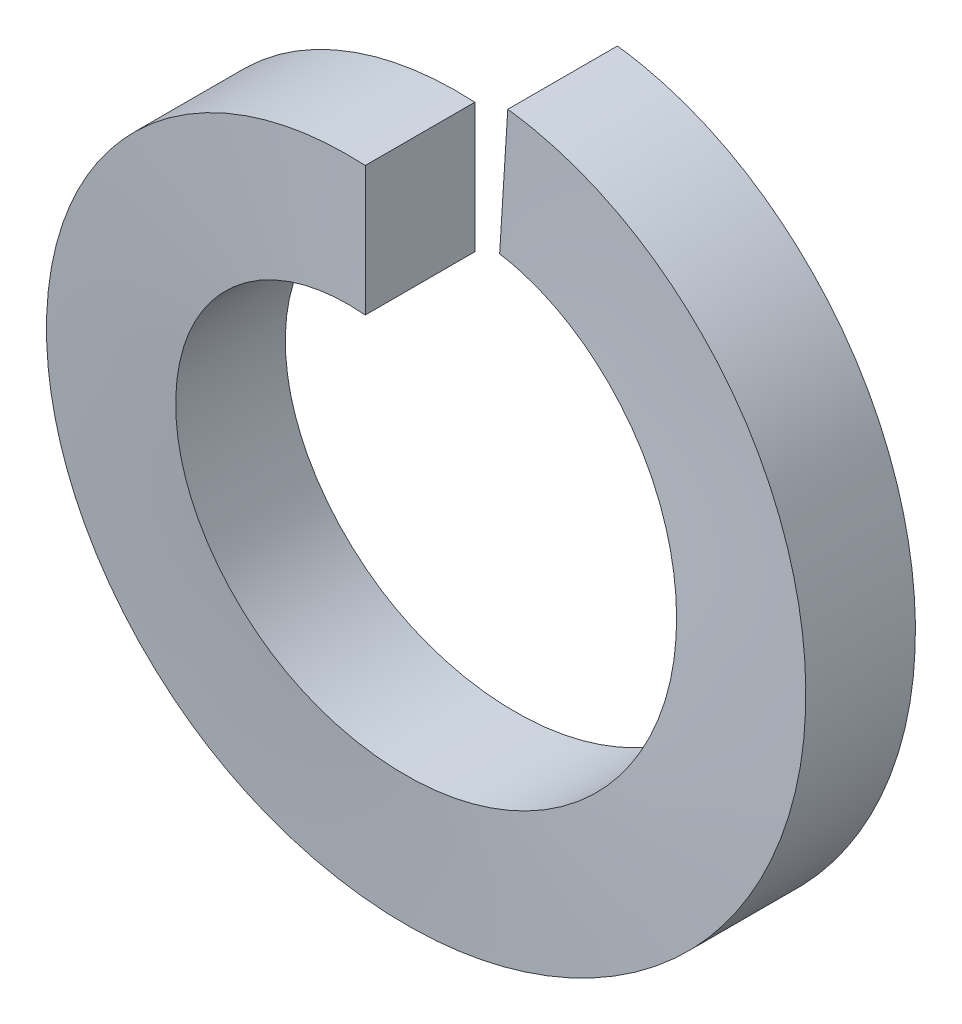
ISO-10303-21;
HEADER;
FILE_DESCRIPTION(('STEP AP214'),'2;1');
FILE_NAME('part.step','',(''),(''),'','','');
FILE_SCHEMA(('AUTOMOTIVE_DESIGN { 1 0 10303 214 1 1 1 1 }'));
ENDSEC;
DATA;
#1=APPLICATION_CONTEXT('core data for automotive mechanical design processes');
#2=APPLICATION_PROTOCOL_DEFINITION('international standard','automotive_design',2000,#1);
#3=PRODUCT_CONTEXT('',#1,'mechanical');
#4=PRODUCT('Part','Part','',(#3));
#5=PRODUCT_RELATED_PRODUCT_CATEGORY('part','',(#4));
#6=PRODUCT_DEFINITION_FORMATION('','',#4);
#7=PRODUCT_DEFINITION_CONTEXT('part definition',#1,'design');
#8=PRODUCT_DEFINITION('design','',#6,#7);
#9=PRODUCT_DEFINITION_SHAPE('','',#8);
#10=(LENGTH_UNIT() NAMED_UNIT(*) SI_UNIT(.MILLI.,.METRE.));
#11=(NAMED_UNIT(*) PLANE_ANGLE_UNIT() SI_UNIT($,.RADIAN.));
#12=(NAMED_UNIT(*) SI_UNIT($,.STERADIAN.) SOLID_ANGLE_UNIT());
#13=UNCERTAINTY_MEASURE_WITH_UNIT(LENGTH_MEASURE(1.E-05),#10,'distance_accuracy_value','');
#14=(GEOMETRIC_REPRESENTATION_CONTEXT(3) GLOBAL_UNCERTAINTY_ASSIGNED_CONTEXT((#13)) GLOBAL_UNIT_ASSIGNED_CONTEXT((#10,
#11,#12)) REPRESENTATION_CONTEXT('',''));
#15=CARTESIAN_POINT('',(0.,0.,0.));
#16=DIRECTION('',(0.,0.,1.));
#17=DIRECTION('',(1.,0.,0.));
#18=AXIS2_PLACEMENT_3D('',#15,#16,#17);
#19=CARTESIAN_POINT('',(0.,2.85,1.1));
#20=DIRECTION('',(1.,0.,0.));
#21=DIRECTION('',(0.,1.,0.));
#22=AXIS2_PLACEMENT_3D('',#19,#20,#21);
#23=PLANE('',#22);
#24=CARTESIAN_POINT('',(0.,3.5,1.1));
#25=CARTESIAN_POINT('',(0.,2.2,1.1));
#26=(BOUNDED_CURVE() B_SPLINE_CURVE(1,(#24,#25),.UNSPECIFIED.,.F.,
.F.) B_SPLINE_CURVE_WITH_KNOTS((2,2),(0.,1.),
.UNSPECIFIED.) CURVE() GEOMETRIC_REPRESENTATION_ITEM() RATIONAL_B_SPLINE_CURVE((1.,1.)) REPRESENTATION_ITEM(''));
#27=CARTESIAN_POINT('',(0.,3.5,1.1));
#28=VERTEX_POINT('',#27);
#29=CARTESIAN_POINT('',(0.,2.2,1.1));
#30=VERTEX_POINT('',#29);
#31=EDGE_CURVE('E32',#28,#30,#26,.T.);
#32=ORIENTED_EDGE('',*,*,#31,.T.);
#33=CARTESIAN_POINT('',(0.,2.2,1.1));
#34=CARTESIAN_POINT('',(0.,2.2,0.));
#35=(BOUNDED_CURVE() B_SPLINE_CURVE(1,(#33,#34),.UNSPECIFIED.,.F.,
.F.) B_SPLINE_CURVE_WITH_KNOTS((2,2),(0.,1.),
.UNSPECIFIED.) CURVE() GEOMETRIC_REPRESENTATION_ITEM() RATIONAL_B_SPLINE_CURVE((1.,1.)) REPRESENTATION_ITEM(''));
#36=CARTESIAN_POINT('',(0.,2.2,0.));
#37=VERTEX_POINT('',#36);
#38=EDGE_CURVE('E91',#30,#37,#35,.T.);
#39=ORIENTED_EDGE('',*,*,#38,.T.);
#40=CARTESIAN_POINT('',(0.,2.2,0.));
#41=CARTESIAN_POINT('',(0.,3.5,0.));
#42=(BOUNDED_CURVE() B_SPLINE_CURVE(1,(#40,#41),.UNSPECIFIED.,.F.,
.F.) B_SPLINE_CURVE_WITH_KNOTS((2,2),(0.,1.),
.UNSPECIFIED.) CURVE() GEOMETRIC_REPRESENTATION_ITEM() RATIONAL_B_SPLINE_CURVE((1.,1.)) REPRESENTATION_ITEM(''));
#43=CARTESIAN_POINT('',(0.,3.5,0.));
#44=VERTEX_POINT('',#43);
#45=EDGE_CURVE('E73',#37,#44,#42,.T.);
#46=ORIENTED_EDGE('',*,*,#45,.T.);
#47=CARTESIAN_POINT('',(0.,3.5,0.));
#48=CARTESIAN_POINT('',(0.,3.5,1.1));
#49=(BOUNDED_CURVE() B_SPLINE_CURVE(1,(#47,#48),.UNSPECIFIED.,.F.,
.F.) B_SPLINE_CURVE_WITH_KNOTS((2,2),(0.,1.),
.UNSPECIFIED.) CURVE() GEOMETRIC_REPRESENTATION_ITEM() RATIONAL_B_SPLINE_CURVE((1.,1.)) REPRESENTATION_ITEM(''));
#50=EDGE_CURVE('E117',#44,#28,#49,.T.);
#51=ORIENTED_EDGE('',*,*,#50,.T.);
#52=EDGE_LOOP('',(#32,#39,#46,#51));
#53=FACE_BOUND('',#52,.T.);
#54=ADVANCED_FACE('F16',(#53),#23,.T.);
#55=CARTESIAN_POINT('',(0.158565109434232,2.52001629083427,-0.110490288185668));
#56=DIRECTION('',(0.998026253327476,-0.0627980631128052,3.06333390339743E-05));
#57=DIRECTION('',(0.,-0.000487807009815868,-0.999999881022154));
#58=AXIS2_PLACEMENT_3D('',#55,#56,#57);
#59=PLANE('',#58);
#60=CARTESIAN_POINT('',(0.219793220997946,3.49309188828513,-0.110490288185668));
#61=CARTESIAN_POINT('',(0.216392495218927,3.43903208027009,-0.110490242989147));
#62=CARTESIAN_POINT('',(0.21299173062682,3.38497227469665,-0.110490197792619));
#63=CARTESIAN_POINT('',(0.206190123816456,3.27685266843367,-0.110490107399545));
#64=CARTESIAN_POINT('',(0.202789281598198,3.22279286774412,-0.110490062203));
#65=CARTESIAN_POINT('',(0.195987519535522,3.11467327124901,-0.110489971809893));
#66=CARTESIAN_POINT('',(0.192586599691102,3.06061347544345,-0.110489926613332));
#67=CARTESIAN_POINT('',(0.185784682376099,2.95249388871638,-0.110489836220192));
#68=CARTESIAN_POINT('',(0.182383684905515,2.89843409779487,-0.110489791023614));
#69=CARTESIAN_POINT('',(0.17558161233817,2.79031452083602,-0.110489700630442));
#70=CARTESIAN_POINT('',(0.17218053724141,2.73625473479866,-0.110489655433847));
#71=CARTESIAN_POINT('',(0.165378309421702,2.62813516760818,-0.110489565040641));
#72=CARTESIAN_POINT('',(0.161977156698754,2.57407538645506,-0.11048951984403));
#73=CARTESIAN_POINT('',(0.155174773626667,2.46595582903312,-0.110489429450792));
#74=CARTESIAN_POINT('',(0.151773543277528,2.41189605276432,-0.110489384254164));
#75=CARTESIAN_POINT('',(0.144971004953047,2.3037765051111,-0.110489293860892));
#76=CARTESIAN_POINT('',(0.141569696977705,2.24971673372669,-0.110489248664248));
#77=CARTESIAN_POINT('',(0.138168350189245,2.19565696478434,-0.110489203467596));
#78=B_SPLINE_CURVE_WITH_KNOTS('',3,(#60,#61,#62,#63,#64,#65,#66,#67,#68,#69,#70,#71,#72,#73,#74,
#75,#76,#77),.UNSPECIFIED.,.F.,.F.,(4,2,2,2,2,2,2,2,4),(0.,0.162500000018584,0.325000000035447,
0.487500000050675,0.650000000064349,0.812500000076553,0.975000000087373,1.13750000009689,
1.30000000010519),.UNSPECIFIED.);
#79=CARTESIAN_POINT('',(0.138168350186876,2.19565696474813,-0.110489203466537));
#80=VERTEX_POINT('',#79);
#81=CARTESIAN_POINT('',(0.219793221214254,3.49309188827152,-0.110490288173973));
#82=VERTEX_POINT('',#81);
#83=EDGE_CURVE('E11',#80,#82,#78,.F.);
#84=ORIENTED_EDGE('',*,*,#83,.T.);
#85=CARTESIAN_POINT('',(0.21981328437909,3.49309062579408,-1.21048920346829));
#86=CARTESIAN_POINT('',(0.21981244841364,3.49309067839973,-1.16465591533109));
#87=CARTESIAN_POINT('',(0.219811612448221,3.49309073100508,-1.11882262719388));
#88=CARTESIAN_POINT('',(0.219809940517444,3.49309083621518,-1.02715605091945));
#89=CARTESIAN_POINT('',(0.219809104552087,3.49309088881992,-0.981322762782233));
#90=CARTESIAN_POINT('',(0.219807432621435,3.4930909940288,-0.889656186507772));
#91=CARTESIAN_POINT('',(0.21980659665614,3.49309104663293,-0.843822898370533));
#92=CARTESIAN_POINT('',(0.219804924725613,3.4930911518406,-0.75215632209604));
#93=CARTESIAN_POINT('',(0.219804088760381,3.49309120444413,-0.706323033958784));
#94=CARTESIAN_POINT('',(0.21980241682998,3.49309130965058,-0.614656457684258));
#95=CARTESIAN_POINT('',(0.21980158086481,3.49309136225351,-0.568823169546986));
#96=CARTESIAN_POINT('',(0.219799908934532,3.49309146745875,-0.477156593272426));
#97=CARTESIAN_POINT('',(0.219799072969423,3.49309152006106,-0.431323305135138));
#98=CARTESIAN_POINT('',(0.219797401039268,3.49309162526509,-0.339656728860546));
#99=CARTESIAN_POINT('',(0.219796565074222,3.4930916778668,-0.293823440723241));
#100=CARTESIAN_POINT('',(0.219794893144191,3.49309178306961,-0.202156864448615));
#101=CARTESIAN_POINT('',(0.219794057179207,3.49309183567072,-0.156323576311294));
#102=CARTESIAN_POINT('',(0.219793221214253,3.49309188827152,-0.110490288173973));
#103=B_SPLINE_CURVE_WITH_KNOTS('',3,(#85,#86,#87,#88,#89,#90,#91,#92,#93,#94,#95,#96,#97,#98,
#99,#100,#101,#102),.UNSPECIFIED.,.F.,.F.,(4,2,2,2,2,2,2,2,4),(0.,0.137499864434578,
0.274999728869206,0.412499593303884,0.549999457738611,0.687499322173387,0.824999186608213,
0.962499051043089,1.09999891547801),.UNSPECIFIED.);
#104=CARTESIAN_POINT('',(0.219813284375469,3.49309062573646,-1.21048920346723));
#105=VERTEX_POINT('',#104);
#106=EDGE_CURVE('E124',#82,#105,#103,.F.);
#107=ORIENTED_EDGE('',*,*,#106,.T.);
#108=CARTESIAN_POINT('',(0.138180961308773,2.19565617115517,-1.21048811876048));
#109=CARTESIAN_POINT('',(0.219833347536685,3.49308936320141,-1.21048811876048));
#110=(BOUNDED_CURVE() B_SPLINE_CURVE(1,(#108,#109),.UNSPECIFIED.,.F.,
.F.) B_SPLINE_CURVE_WITH_KNOTS((2,2),(0.,1.),
.UNSPECIFIED.) CURVE() GEOMETRIC_REPRESENTATION_ITEM() RATIONAL_B_SPLINE_CURVE((0.988586356224895,0.988586356224895)) REPRESENTATION_ITEM(''));
#111=CARTESIAN_POINT('',(0.138180961460757,2.1956561711456,-1.21048811874741));
#112=VERTEX_POINT('',#111);
#113=EDGE_CURVE('E85',#105,#112,#110,.F.);
#114=ORIENTED_EDGE('',*,*,#113,.T.);
#115=CARTESIAN_POINT('',(0.138168350191429,2.19565696482056,-0.11048920346867));
#116=CARTESIAN_POINT('',(0.138168875660984,2.19565693175077,-0.156322491605284));
#117=CARTESIAN_POINT('',(0.138169401130539,2.19565689868098,-0.202155779741898));
#118=CARTESIAN_POINT('',(0.138170452069649,2.1956568325414,-0.293822356015126));
#119=CARTESIAN_POINT('',(0.138170977539204,2.19565679947161,-0.33965564415174));
#120=CARTESIAN_POINT('',(0.138172028478316,2.19565673333203,-0.431322220424968));
#121=CARTESIAN_POINT('',(0.138172553947872,2.19565670026224,-0.477155508561582));
#122=CARTESIAN_POINT('',(0.138173604886983,2.19565663412266,-0.56882208483481));
#123=CARTESIAN_POINT('',(0.138174130356538,2.19565660105287,-0.614655372971424));
#124=CARTESIAN_POINT('',(0.138175181295648,2.19565653491329,-0.706321949244652));
#125=CARTESIAN_POINT('',(0.138175706765203,2.1956565018435,-0.752155237381266));
#126=CARTESIAN_POINT('',(0.138176757704314,2.19565643570392,-0.843821813654494));
#127=CARTESIAN_POINT('',(0.13817728317387,2.19565640263413,-0.889655101791108));
#128=CARTESIAN_POINT('',(0.138178334112981,2.19565633649455,-0.981321678064336));
#129=CARTESIAN_POINT('',(0.138178859582537,2.19565630342476,-1.02715496620095));
#130=CARTESIAN_POINT('',(0.138179910521647,2.19565623728518,-1.11882154247418));
#131=CARTESIAN_POINT('',(0.138180435991202,2.19565620421539,-1.16465483061079));
#132=CARTESIAN_POINT('',(0.138180961460757,2.1956561711456,-1.21048811874741));
#133=B_SPLINE_CURVE_WITH_KNOTS('',3,(#115,#116,#117,#118,#119,#120,#121,#122,#123,#124,#125,
#126,#127,#128,#129,#130,#131,#132),.UNSPECIFIED.,.F.,.F.,(4,2,2,2,2,2,2,2,4),(0.,
0.137499864418914,0.274999728837829,0.412499593256743,0.549999457675657,0.687499322094572,
0.824999186513486,0.9624990509324,1.09999891535131),.UNSPECIFIED.);
#134=EDGE_CURVE('E92',#112,#80,#133,.F.);
#135=ORIENTED_EDGE('',*,*,#134,.T.);
#136=EDGE_LOOP('',(#84,#107,#114,#135));
#137=FACE_BOUND('',#136,.T.);
#138=ADVANCED_FACE('F134',(#137),#59,.F.);
#139=CARTESIAN_POINT('',(0.,3.5,1.1));
#140=CARTESIAN_POINT('',(-1.44974746830583,3.5,1.02361111111111));
#141=CARTESIAN_POINT('',(-2.47487373415292,2.47487373415292,0.947222222222222));
#142=CARTESIAN_POINT('',(-3.5,1.44974746830583,0.870833333333334));
#143=CARTESIAN_POINT('',(-3.5,0.,0.794444444444445));
#144=CARTESIAN_POINT('',(-3.5,-1.44974746830583,0.718055555555555));
#145=CARTESIAN_POINT('',(-2.47487373415292,-2.47487373415292,0.641666666666667));
#146=CARTESIAN_POINT('',(-1.44974746830583,-3.5,0.565277777777777));
#147=CARTESIAN_POINT('',(0.,-3.5,0.488888888888889));
#148=CARTESIAN_POINT('',(1.44974746830583,-3.5,0.4125));
#149=CARTESIAN_POINT('',(2.47487373415292,-2.47487373415292,0.336111111111111));
#150=CARTESIAN_POINT('',(3.5,-1.44974746830583,0.259722222222222));
#151=CARTESIAN_POINT('',(3.5,0.,0.183333333333333));
#152=CARTESIAN_POINT('',(3.5,1.44974746830583,0.106944444444444));
#153=CARTESIAN_POINT('',(2.47487373415292,2.47487373415292,0.0305555555555553));
#154=CARTESIAN_POINT('',(1.53970756807716,3.41003990022867,-0.0391298156352609));
#155=CARTESIAN_POINT('',(0.219793220997946,3.49309188828513,-0.110490288185668));
#156=CARTESIAN_POINT('',(0.,2.2,1.1));
#157=CARTESIAN_POINT('',(-0.91126983722081,2.2,1.02361111111111));
#158=CARTESIAN_POINT('',(-1.55563491861041,1.55563491861041,0.947222222222222));
#159=CARTESIAN_POINT('',(-2.2,0.91126983722081,0.870833333333334));
#160=CARTESIAN_POINT('',(-2.2,0.,0.794444444444444));
#161=CARTESIAN_POINT('',(-2.2,-0.91126983722081,0.718055555555555));
#162=CARTESIAN_POINT('',(-1.55563491861041,-1.55563491861041,0.641666666666667));
#163=CARTESIAN_POINT('',(-0.91126983722081,-2.2,0.565277777777777));
#164=CARTESIAN_POINT('',(0.,-2.2,0.488888888888889));
#165=CARTESIAN_POINT('',(0.911269837220808,-2.2,0.4125));
#166=CARTESIAN_POINT('',(1.55563491861041,-1.55563491861041,0.336111111111111));
#167=CARTESIAN_POINT('',(2.2,-0.911269837220811,0.259722222222222));
#168=CARTESIAN_POINT('',(2.2,0.,0.183333333333333));
#169=CARTESIAN_POINT('',(2.2,0.91126983722081,0.106944444444444));
#170=CARTESIAN_POINT('',(1.55563491861041,1.55563491861041,0.0305555555555551));
#171=CARTESIAN_POINT('',(0.9678161856485,2.14345365157231,-0.0391298156352611));
#172=CARTESIAN_POINT('',(0.138155738912994,2.19565775835065,-0.110490288185668));
#173=(BOUNDED_SURFACE() B_SPLINE_SURFACE(1,2,((#139,#140,#141,#142,#143,#144,#145,#146,#147,
#148,#149,#150,#151,#152,#153,#154,#155),(#156,#157,#158,#159,#160,#161,#162,#163,#164,#165,
#166,#167,#168,#169,#170,#171,#172)),.UNSPECIFIED.,.F.,.F.,.F.) B_SPLINE_SURFACE_WITH_KNOTS((2,
2),(3,2,2,2,2,2,2,2,3),(0.,1.),(0.,0.125,0.25,0.375,0.5,0.625,0.75,0.875,0.989797450046227),
.UNSPECIFIED.) GEOMETRIC_REPRESENTATION_ITEM() RATIONAL_B_SPLINE_SURFACE(((1.,0.923879532511287,
1.,0.923879532511287,1.,0.923879532511287,1.,0.923879532511287,1.,0.923879532511287,1.,
0.923879532511287,1.,0.923879532511287,1.,0.930092515487752,0.988588246353938),(1.,
0.923879532511287,1.,0.923879532511287,1.,0.923879532511287,1.,0.923879532511287,1.,
0.923879532511287,1.,0.923879532511287,1.,0.923879532511287,1.,0.930092515487752,0.988588246353938))) REPRESENTATION_ITEM('') SURFACE());
#174=CARTESIAN_POINT('',(0.,3.5,1.1));
#175=CARTESIAN_POINT('',(-1.44974746830583,3.5,1.02361111111111));
#176=CARTESIAN_POINT('',(-2.47487373415292,2.47487373415292,0.947222222222222));
#177=CARTESIAN_POINT('',(-3.5,1.44974746830583,0.870833333333334));
#178=CARTESIAN_POINT('',(-3.5,0.,0.794444444444445));
#179=CARTESIAN_POINT('',(-3.5,-1.44974746830583,0.718055555555555));
#180=CARTESIAN_POINT('',(-2.47487373415292,-2.47487373415292,0.641666666666667));
#181=CARTESIAN_POINT('',(-1.44974746830583,-3.5,0.565277777777778));
#182=CARTESIAN_POINT('',(0.,-3.5,0.488888888888889));
#183=CARTESIAN_POINT('',(1.44974746830583,-3.5,0.4125));
#184=CARTESIAN_POINT('',(2.47487373415292,-2.47487373415292,0.336111111111111));
#185=CARTESIAN_POINT('',(3.5,-1.44974746830583,0.259722222222222));
#186=CARTESIAN_POINT('',(3.5,0.,0.183333333333333));
#187=CARTESIAN_POINT('',(3.5,1.44974746830583,0.106944444444444));
#188=CARTESIAN_POINT('',(2.47487373415292,2.47487373415292,0.0305555555555553));
#189=CARTESIAN_POINT('',(1.53970756816473,3.4100399001411,-0.0391298156287355));
#190=CARTESIAN_POINT('',(0.219793221214253,3.49309188827152,-0.110490288173973));
#191=(BOUNDED_CURVE() B_SPLINE_CURVE(2,(#174,#175,#176,#177,#178,#179,#180,#181,#182,#183,#184,
#185,#186,#187,#188,#189,#190),.UNSPECIFIED.,.F.,.F.) B_SPLINE_CURVE_WITH_KNOTS((3,2,2,2,2,2,2,
2,3),(0.,0.125,0.25,0.375,0.5,0.625,0.75,0.875,0.989797450036228),
.UNSPECIFIED.) CURVE() GEOMETRIC_REPRESENTATION_ITEM() RATIONAL_B_SPLINE_CURVE((1.,
0.923879532511287,1.,0.923879532511287,1.,0.923879532511287,1.,0.923879532511287,1.,
0.923879532511287,1.,0.923879532511287,1.,0.923879532511287,1.,0.930092515493841,0.988588246343749)) REPRESENTATION_ITEM(''));
#192=EDGE_CURVE('E116',#28,#82,#191,.T.);
#193=CARTESIAN_POINT('',(0.,2.2,1.1));
#194=CARTESIAN_POINT('',(-0.91126983722081,2.2,1.02361111111111));
#195=CARTESIAN_POINT('',(-1.55563491861041,1.55563491861041,0.947222222222222));
#196=CARTESIAN_POINT('',(-2.2,0.91126983722081,0.870833333333333));
#197=CARTESIAN_POINT('',(-2.2,0.,0.794444444444444));
#198=CARTESIAN_POINT('',(-2.2,-0.911269837220808,0.718055555555555));
#199=CARTESIAN_POINT('',(-1.55563491861041,-1.55563491861041,0.641666666666667));
#200=CARTESIAN_POINT('',(-0.91126983722081,-2.2,0.565277777777777));
#201=CARTESIAN_POINT('',(0.,-2.2,0.488888888888889));
#202=CARTESIAN_POINT('',(0.911269837220808,-2.2,0.4125));
#203=CARTESIAN_POINT('',(1.55563491861041,-1.55563491861041,0.336111111111111));
#204=CARTESIAN_POINT('',(2.2,-0.911269837220811,0.259722222222222));
#205=CARTESIAN_POINT('',(2.2,0.,0.183333333333333));
#206=CARTESIAN_POINT('',(2.2,0.91126983722081,0.106944444444444));
#207=CARTESIAN_POINT('',(1.55563491861041,1.55563491861041,0.0305555555555552));
#208=CARTESIAN_POINT('',(0.967826396556228,2.14344344066458,-0.0391286051415231));
#209=CARTESIAN_POINT('',(0.138180961460757,2.1956561711456,-0.110488118747406));
#210=CARTESIAN_POINT('',(0.138168350179378,2.19565696482132,-0.110489203469707));
#211=CARTESIAN_POINT('',(0.138168350186876,2.19565696474812,-0.110489203466537));
#212=(BOUNDED_CURVE() B_SPLINE_CURVE(2,(#193,#194,#195,#196,#197,#198,#199,#200,#201,#202,#203,
#204,#205,#206,#207,#208,#209,#210,#211),.UNSPECIFIED.,.F.,.F.) B_SPLINE_CURVE_WITH_KNOTS((3,2,
2,2,2,2,2,2,2,3),(0.,0.126288464366282,0.252576928732564,0.378865393098847,0.505153857465129,
0.631442321831412,0.757730786197694,0.884019250563976,0.999998126155635,1.),
.UNSPECIFIED.) CURVE() GEOMETRIC_REPRESENTATION_ITEM() RATIONAL_B_SPLINE_CURVE((1.,
0.923879532511287,1.,0.923879532511287,1.,0.923879532511287,1.,0.923879532511287,1.,
0.923879532511287,1.,0.923879532511287,1.,0.923879532511287,1.,0.930093644948861,
0.988586356213506,0.988586356213506,0.988586356213506)) REPRESENTATION_ITEM(''));
#213=EDGE_CURVE('E97',#30,#80,#212,.T.);
#214=ORIENTED_EDGE('',*,*,#31,.F.);
#215=ORIENTED_EDGE('',*,*,#192,.T.);
#216=ORIENTED_EDGE('',*,*,#83,.F.);
#217=ORIENTED_EDGE('',*,*,#213,.F.);
#218=EDGE_LOOP('',(#214,#215,#216,#217));
#219=FACE_BOUND('',#218,.T.);
#220=ADVANCED_FACE('F18',(#219),#173,.F.);
#221=CARTESIAN_POINT('',(0.,3.5,0.));
#222=CARTESIAN_POINT('',(-1.44974746830583,3.5,-0.0763888888888889));
#223=CARTESIAN_POINT('',(-2.47487373415292,2.47487373415292,-0.152777777777778));
#224=CARTESIAN_POINT('',(-3.5,1.44974746830583,-0.229166666666667));
#225=CARTESIAN_POINT('',(-3.5,0.,-0.305555555555555));
#226=CARTESIAN_POINT('',(-3.5,-1.44974746830583,-0.381944444444444));
#227=CARTESIAN_POINT('',(-2.47487373415292,-2.47487373415292,-0.458333333333333));
#228=CARTESIAN_POINT('',(-1.44974746830583,-3.5,-0.534722222222222));
#229=CARTESIAN_POINT('',(0.,-3.5,-0.611111111111111));
#230=CARTESIAN_POINT('',(1.44974746830583,-3.5,-0.6875));
#231=CARTESIAN_POINT('',(2.47487373415292,-2.47487373415292,-0.763888888888889));
#232=CARTESIAN_POINT('',(3.5,-1.44974746830583,-0.840277777777777));
#233=CARTESIAN_POINT('',(3.5,0.,-0.916666666666667));
#234=CARTESIAN_POINT('',(3.5,1.44974746830583,-0.993055555555556));
#235=CARTESIAN_POINT('',(2.47487373415292,2.47487373415292,-1.06944444444444));
#236=CARTESIAN_POINT('',(1.53970756816473,3.4100399001411,-1.13912981562873));
#237=CARTESIAN_POINT('',(0.219793221214253,3.49309188827152,-1.21049028817397));
#238=CARTESIAN_POINT('',(0.,3.5,1.1));
#239=CARTESIAN_POINT('',(-1.44974746830583,3.5,1.02361111111111));
#240=CARTESIAN_POINT('',(-2.47487373415292,2.47487373415292,0.947222222222222));
#241=CARTESIAN_POINT('',(-3.5,1.44974746830583,0.870833333333334));
#242=CARTESIAN_POINT('',(-3.5,0.,0.794444444444445));
#243=CARTESIAN_POINT('',(-3.5,-1.44974746830583,0.718055555555555));
#244=CARTESIAN_POINT('',(-2.47487373415292,-2.47487373415292,0.641666666666667));
#245=CARTESIAN_POINT('',(-1.44974746830583,-3.5,0.565277777777777));
#246=CARTESIAN_POINT('',(0.,-3.5,0.488888888888889));
#247=CARTESIAN_POINT('',(1.44974746830583,-3.5,0.4125));
#248=CARTESIAN_POINT('',(2.47487373415292,-2.47487373415292,0.336111111111111));
#249=CARTESIAN_POINT('',(3.5,-1.44974746830583,0.259722222222222));
#250=CARTESIAN_POINT('',(3.5,0.,0.183333333333333));
#251=CARTESIAN_POINT('',(3.5,1.44974746830583,0.106944444444444));
#252=CARTESIAN_POINT('',(2.47487373415292,2.47487373415292,0.0305555555555553));
#253=CARTESIAN_POINT('',(1.53970756816473,3.4100399001411,-0.0391298156287355));
#254=CARTESIAN_POINT('',(0.219793221214253,3.49309188827152,-0.110490288173973));
#255=(BOUNDED_SURFACE() B_SPLINE_SURFACE(1,2,((#221,#222,#223,#224,#225,#226,#227,#228,#229,
#230,#231,#232,#233,#234,#235,#236,#237),(#238,#239,#240,#241,#242,#243,#244,#245,#246,#247,
#248,#249,#250,#251,#252,#253,#254)),.UNSPECIFIED.,.F.,.F.,.F.) B_SPLINE_SURFACE_WITH_KNOTS((2,
2),(3,2,2,2,2,2,2,2,3),(0.,1.),(0.,0.125,0.25,0.375,0.5,0.625,0.75,0.875,0.989797450036228),
.UNSPECIFIED.) GEOMETRIC_REPRESENTATION_ITEM() RATIONAL_B_SPLINE_SURFACE(((1.,0.923879532511287,
1.,0.923879532511287,1.,0.923879532511287,1.,0.923879532511287,1.,0.923879532511287,1.,
0.923879532511287,1.,0.923879532511287,1.,0.930092515493841,0.988588246343749),(1.,
0.923879532511287,1.,0.923879532511287,1.,0.923879532511287,1.,0.923879532511287,1.,
0.923879532511287,1.,0.923879532511287,1.,0.923879532511287,1.,0.930092515493841,0.988588246343749))) REPRESENTATION_ITEM('') SURFACE());
#256=CARTESIAN_POINT('',(0.,3.5,0.));
#257=CARTESIAN_POINT('',(-1.44974746830583,3.5,-0.0763888888888891));
#258=CARTESIAN_POINT('',(-2.47487373415292,2.47487373415292,-0.152777777777778));
#259=CARTESIAN_POINT('',(-3.5,1.44974746830583,-0.229166666666667));
#260=CARTESIAN_POINT('',(-3.5,0.,-0.305555555555556));
#261=CARTESIAN_POINT('',(-3.5,-1.44974746830583,-0.381944444444445));
#262=CARTESIAN_POINT('',(-2.47487373415292,-2.47487373415292,-0.458333333333334));
#263=CARTESIAN_POINT('',(-1.44974746830583,-3.5,-0.534722222222223));
#264=CARTESIAN_POINT('',(0.,-3.5,-0.611111111111111));
#265=CARTESIAN_POINT('',(1.44974746830583,-3.5,-0.6875));
#266=CARTESIAN_POINT('',(2.47487373415292,-2.47487373415292,-0.763888888888889));
#267=CARTESIAN_POINT('',(3.5,-1.44974746830583,-0.840277777777778));
#268=CARTESIAN_POINT('',(3.5,0.,-0.916666666666667));
#269=CARTESIAN_POINT('',(3.5,1.44974746830583,-0.993055555555556));
#270=CARTESIAN_POINT('',(2.47487373415292,2.47487373415292,-1.06944444444444));
#271=CARTESIAN_POINT('',(1.5397238126052,3.41002365570063,-1.13912860514882));
#272=CARTESIAN_POINT('',(0.219813284375469,3.49309062573646,-1.21048920346723));
#273=(BOUNDED_CURVE() B_SPLINE_CURVE(2,(#256,#257,#258,#259,#260,#261,#262,#263,#264,#265,#266,
#267,#268,#269,#270,#271,#272),.UNSPECIFIED.,.F.,.F.) B_SPLINE_CURVE_WITH_KNOTS((3,2,2,2,2,2,2,
2,3),(0.,0.126288701010227,0.252577402020454,0.378866103030682,0.505154804040908,
0.631443505051135,0.757732206061363,0.88402090707159,1.),
.UNSPECIFIED.) CURVE() GEOMETRIC_REPRESENTATION_ITEM() RATIONAL_B_SPLINE_CURVE((1.,
0.923879532511287,1.,0.923879532511287,1.,0.923879532511287,1.,0.923879532511287,1.,
0.923879532511287,1.,0.923879532511287,1.,0.923879532511287,1.,0.930093644942056,0.988586356224895)) REPRESENTATION_ITEM(''));
#274=EDGE_CURVE('E80',#44,#105,#273,.T.);
#275=ORIENTED_EDGE('',*,*,#50,.F.);
#276=ORIENTED_EDGE('',*,*,#274,.T.);
#277=ORIENTED_EDGE('',*,*,#106,.F.);
#278=ORIENTED_EDGE('',*,*,#192,.F.);
#279=EDGE_LOOP('',(#275,#276,#277,#278));
#280=FACE_BOUND('',#279,.T.);
#281=ADVANCED_FACE('F177',(#280),#255,.F.);
#282=CARTESIAN_POINT('',(0.,2.2,0.));
#283=CARTESIAN_POINT('',(-0.91126983722081,2.2,-0.0763888888888889));
#284=CARTESIAN_POINT('',(-1.55563491861041,1.55563491861041,-0.152777777777778));
#285=CARTESIAN_POINT('',(-2.2,0.91126983722081,-0.229166666666667));
#286=CARTESIAN_POINT('',(-2.2,0.,-0.305555555555555));
#287=CARTESIAN_POINT('',(-2.2,-0.91126983722081,-0.381944444444444));
#288=CARTESIAN_POINT('',(-1.55563491861041,-1.55563491861041,-0.458333333333333));
#289=CARTESIAN_POINT('',(-0.91126983722081,-2.2,-0.534722222222222));
#290=CARTESIAN_POINT('',(0.,-2.2,-0.611111111111111));
#291=CARTESIAN_POINT('',(0.911269837220808,-2.2,-0.6875));
#292=CARTESIAN_POINT('',(1.55563491861041,-1.55563491861041,-0.763888888888889));
#293=CARTESIAN_POINT('',(2.2,-0.911269837220811,-0.840277777777777));
#294=CARTESIAN_POINT('',(2.2,0.,-0.916666666666667));
#295=CARTESIAN_POINT('',(2.2,0.91126983722081,-0.993055555555556));
#296=CARTESIAN_POINT('',(1.55563491861041,1.55563491861041,-1.06944444444444));
#297=CARTESIAN_POINT('',(0.9678263964947,2.14344344072611,-1.13912860514882));
#298=CARTESIAN_POINT('',(0.138180961308773,2.19565617115517,-1.21048811876048));
#299=CARTESIAN_POINT('',(0.,3.5,0.));
#300=CARTESIAN_POINT('',(-1.44974746830583,3.5,-0.0763888888888889));
#301=CARTESIAN_POINT('',(-2.47487373415292,2.47487373415292,-0.152777777777778));
#302=CARTESIAN_POINT('',(-3.5,1.44974746830583,-0.229166666666667));
#303=CARTESIAN_POINT('',(-3.5,0.,-0.305555555555555));
#304=CARTESIAN_POINT('',(-3.5,-1.44974746830583,-0.381944444444444));
#305=CARTESIAN_POINT('',(-2.47487373415292,-2.47487373415292,-0.458333333333333));
#306=CARTESIAN_POINT('',(-1.44974746830583,-3.5,-0.534722222222222));
#307=CARTESIAN_POINT('',(0.,-3.5,-0.611111111111111));
#308=CARTESIAN_POINT('',(1.44974746830583,-3.5,-0.6875));
#309=CARTESIAN_POINT('',(2.47487373415292,-2.47487373415292,-0.763888888888889));
#310=CARTESIAN_POINT('',(3.5,-1.44974746830583,-0.840277777777777));
#311=CARTESIAN_POINT('',(3.5,0.,-0.916666666666667));
#312=CARTESIAN_POINT('',(3.5,1.44974746830583,-0.993055555555556));
#313=CARTESIAN_POINT('',(2.47487373415292,2.47487373415292,-1.06944444444444));
#314=CARTESIAN_POINT('',(1.5397238126052,3.41002365570063,-1.13912860514882));
#315=CARTESIAN_POINT('',(0.219833347536685,3.49308936320141,-1.21048811876048));
#316=(BOUNDED_SURFACE() B_SPLINE_SURFACE(1,2,((#282,#283,#284,#285,#286,#287,#288,#289,#290,
#291,#292,#293,#294,#295,#296,#297,#298),(#299,#300,#301,#302,#303,#304,#305,#306,#307,#308,
#309,#310,#311,#312,#313,#314,#315)),.UNSPECIFIED.,.F.,.F.,.F.) B_SPLINE_SURFACE_WITH_KNOTS((2,
2),(3,2,2,2,2,2,2,2,3),(0.,1.),(0.,0.125,0.25,0.375,0.5,0.625,0.75,0.875,0.989795595331028),
.UNSPECIFIED.) GEOMETRIC_REPRESENTATION_ITEM() RATIONAL_B_SPLINE_SURFACE(((1.,0.923879532511287,
1.,0.923879532511287,1.,0.923879532511287,1.,0.923879532511287,1.,0.923879532511287,1.,
0.923879532511287,1.,0.923879532511287,1.,0.930093644942056,0.988586356224895),(1.,
0.923879532511287,1.,0.923879532511287,1.,0.923879532511287,1.,0.923879532511287,1.,
0.923879532511287,1.,0.923879532511287,1.,0.923879532511287,1.,0.930093644942056,0.988586356224895))) REPRESENTATION_ITEM('') SURFACE());
#317=CARTESIAN_POINT('',(0.,2.2,0.));
#318=CARTESIAN_POINT('',(-0.91126983722081,2.2,-0.0763888888888889));
#319=CARTESIAN_POINT('',(-1.55563491861041,1.55563491861041,-0.152777777777778));
#320=CARTESIAN_POINT('',(-2.2,0.91126983722081,-0.229166666666667));
#321=CARTESIAN_POINT('',(-2.2,0.,-0.305555555555555));
#322=CARTESIAN_POINT('',(-2.2,-0.91126983722081,-0.381944444444444));
#323=CARTESIAN_POINT('',(-1.55563491861041,-1.55563491861041,-0.458333333333333));
#324=CARTESIAN_POINT('',(-0.91126983722081,-2.2,-0.534722222222222));
#325=CARTESIAN_POINT('',(0.,-2.2,-0.611111111111111));
#326=CARTESIAN_POINT('',(0.911269837220808,-2.2,-0.6875));
#327=CARTESIAN_POINT('',(1.55563491861041,-1.55563491861041,-0.763888888888889));
#328=CARTESIAN_POINT('',(2.2,-0.911269837220811,-0.840277777777777));
#329=CARTESIAN_POINT('',(2.2,0.,-0.916666666666667));
#330=CARTESIAN_POINT('',(2.2,0.91126983722081,-0.993055555555556));
#331=CARTESIAN_POINT('',(1.55563491861041,1.55563491861041,-1.06944444444444));
#332=CARTESIAN_POINT('',(0.967826396556228,2.14344344066458,-1.13912860514152));
#333=CARTESIAN_POINT('',(0.138180961460757,2.1956561711456,-1.21048811874741));
#334=(BOUNDED_CURVE() B_SPLINE_CURVE(2,(#317,#318,#319,#320,#321,#322,#323,#324,#325,#326,#327,
#328,#329,#330,#331,#332,#333),.UNSPECIFIED.,.F.,.F.) B_SPLINE_CURVE_WITH_KNOTS((3,2,2,2,2,2,2,
2,3),(0.,0.125,0.25,0.375,0.5,0.625,0.75,0.875,0.989795595319852),
.UNSPECIFIED.) CURVE() GEOMETRIC_REPRESENTATION_ITEM() RATIONAL_B_SPLINE_CURVE((1.,
0.923879532511287,1.,0.923879532511287,1.,0.923879532511287,1.,0.923879532511287,1.,
0.923879532511287,1.,0.923879532511287,1.,0.923879532511287,1.,0.930093644948861,0.988586356213506)) REPRESENTATION_ITEM(''));
#335=EDGE_CURVE('E77',#37,#112,#334,.T.);
#336=ORIENTED_EDGE('',*,*,#45,.F.);
#337=ORIENTED_EDGE('',*,*,#335,.T.);
#338=ORIENTED_EDGE('',*,*,#113,.F.);
#339=ORIENTED_EDGE('',*,*,#274,.F.);
#340=EDGE_LOOP('',(#336,#337,#338,#339));
#341=FACE_BOUND('',#340,.T.);
#342=ADVANCED_FACE('F75',(#341),#316,.F.);
#343=CARTESIAN_POINT('',(0.,2.2,1.1));
#344=CARTESIAN_POINT('',(-0.91126983722081,2.2,1.02361111111111));
#345=CARTESIAN_POINT('',(-1.55563491861041,1.55563491861041,0.947222222222222));
#346=CARTESIAN_POINT('',(-2.2,0.91126983722081,0.870833333333334));
#347=CARTESIAN_POINT('',(-2.2,0.,0.794444444444444));
#348=CARTESIAN_POINT('',(-2.2,-0.91126983722081,0.718055555555555));
#349=CARTESIAN_POINT('',(-1.55563491861041,-1.55563491861041,0.641666666666667));
#350=CARTESIAN_POINT('',(-0.91126983722081,-2.2,0.565277777777777));
#351=CARTESIAN_POINT('',(0.,-2.2,0.488888888888889));
#352=CARTESIAN_POINT('',(0.911269837220808,-2.2,0.4125));
#353=CARTESIAN_POINT('',(1.55563491861041,-1.55563491861041,0.336111111111111));
#354=CARTESIAN_POINT('',(2.2,-0.911269837220811,0.259722222222222));
#355=CARTESIAN_POINT('',(2.2,0.,0.183333333333333));
#356=CARTESIAN_POINT('',(2.2,0.91126983722081,0.106944444444444));
#357=CARTESIAN_POINT('',(1.55563491861041,1.55563491861041,0.0305555555555551));
#358=CARTESIAN_POINT('',(0.967826396556228,2.14344344066458,-0.0391286051415233));
#359=CARTESIAN_POINT('',(0.138180961460757,2.1956561711456,-0.110488118747406));
#360=CARTESIAN_POINT('',(0.0708794396058538,2.199891710899,-0.116276861337123));
#361=CARTESIAN_POINT('',(0.00357791775095026,2.2041272506524,-0.122065603926841));
#362=CARTESIAN_POINT('',(0.,2.2,0.));
#363=CARTESIAN_POINT('',(-0.91126983722081,2.2,-0.0763888888888889));
#364=CARTESIAN_POINT('',(-1.55563491861041,1.55563491861041,-0.152777777777778));
#365=CARTESIAN_POINT('',(-2.2,0.91126983722081,-0.229166666666667));
#366=CARTESIAN_POINT('',(-2.2,0.,-0.305555555555555));
#367=CARTESIAN_POINT('',(-2.2,-0.91126983722081,-0.381944444444444));
#368=CARTESIAN_POINT('',(-1.55563491861041,-1.55563491861041,-0.458333333333333));
#369=CARTESIAN_POINT('',(-0.91126983722081,-2.2,-0.534722222222222));
#370=CARTESIAN_POINT('',(0.,-2.2,-0.611111111111111));
#371=CARTESIAN_POINT('',(0.911269837220808,-2.2,-0.6875));
#372=CARTESIAN_POINT('',(1.55563491861041,-1.55563491861041,-0.763888888888889));
#373=CARTESIAN_POINT('',(2.2,-0.911269837220811,-0.840277777777777));
#374=CARTESIAN_POINT('',(2.2,0.,-0.916666666666667));
#375=CARTESIAN_POINT('',(2.2,0.91126983722081,-0.993055555555556));
#376=CARTESIAN_POINT('',(1.55563491861041,1.55563491861041,-1.06944444444444));
#377=CARTESIAN_POINT('',(0.967826396556228,2.14344344066458,-1.13912860514152));
#378=CARTESIAN_POINT('',(0.138180961460757,2.1956561711456,-1.21048811874741));
#379=CARTESIAN_POINT('',(0.0708794396058538,2.199891710899,-1.21627686133712));
#380=CARTESIAN_POINT('',(0.00357791775095022,2.2041272506524,-1.22206560392684));
#381=(BOUNDED_SURFACE() B_SPLINE_SURFACE(1,2,((#343,#344,#345,#346,#347,#348,#349,#350,#351,
#352,#353,#354,#355,#356,#357,#358,#359,#360,#361),(#362,#363,#364,#365,#366,#367,#368,#369,
#370,#371,#372,#373,#374,#375,#376,#377,#378,#379,#380)),.UNSPECIFIED.,.F.,.F.,
.F.) B_SPLINE_SURFACE_WITH_KNOTS((2,2),(3,2,2,2,2,2,2,2,2,3),(0.,1.),(0.,0.125,0.25,0.375,0.5,
0.625,0.75,0.875,0.989795595319852,0.999693551273051),
.UNSPECIFIED.) GEOMETRIC_REPRESENTATION_ITEM() RATIONAL_B_SPLINE_SURFACE(((1.,0.923879532511287,
1.,0.923879532511287,1.,0.923879532511287,1.,0.923879532511287,1.,0.923879532511287,1.,
0.923879532511287,1.,0.923879532511287,1.,0.930093644948861,0.988586356213506,0.988586356213506,
0.988586356213506),(1.,0.923879532511287,1.,0.923879532511287,1.,0.923879532511287,1.,
0.923879532511287,1.,0.923879532511287,1.,0.923879532511287,1.,0.923879532511287,1.,
0.930093644948861,0.988586356213506,0.988586356213506,0.988586356213506))) REPRESENTATION_ITEM('') SURFACE());
#382=ORIENTED_EDGE('',*,*,#38,.F.);
#383=ORIENTED_EDGE('',*,*,#213,.T.);
#384=ORIENTED_EDGE('',*,*,#134,.F.);
#385=ORIENTED_EDGE('',*,*,#335,.F.);
#386=EDGE_LOOP('',(#382,#383,#384,#385));
#387=FACE_BOUND('',#386,.T.);
#388=ADVANCED_FACE('F89',(#387),#381,.F.);
#389=CLOSED_SHELL('',(#54,#138,#220,#281,#342,#388));
#390=MANIFOLD_SOLID_BREP('B1',#389);
#391=ADVANCED_BREP_SHAPE_REPRESENTATION('',(#18,#390),#14);
#392=SHAPE_DEFINITION_REPRESENTATION(#9,#391);
ENDSEC;
END-ISO-10303-21;
